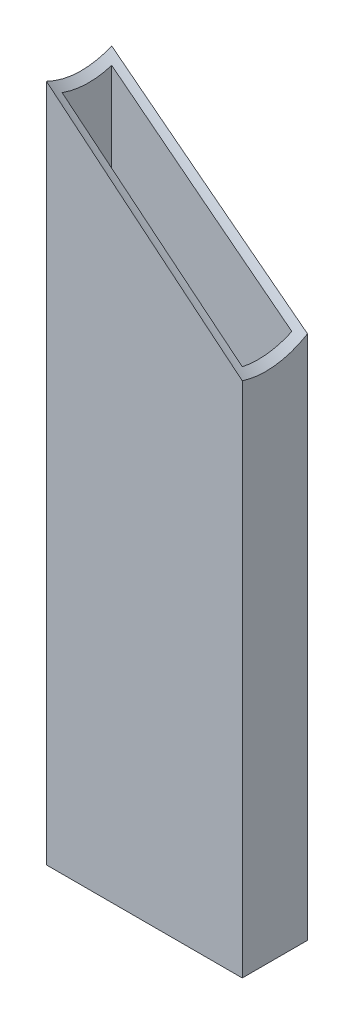
ISO-10303-21;
HEADER;
FILE_DESCRIPTION(('STEP AP214'),'2;1');
FILE_NAME('part.step','',(''),(''),'','','');
FILE_SCHEMA(('AUTOMOTIVE_DESIGN { 1 0 10303 214 1 1 1 1 }'));
ENDSEC;
DATA;
#1=APPLICATION_CONTEXT('core data for automotive mechanical design processes');
#2=APPLICATION_PROTOCOL_DEFINITION('international standard','automotive_design',2000,#1);
#3=PRODUCT_CONTEXT('',#1,'mechanical');
#4=PRODUCT('Part','Part','',(#3));
#5=PRODUCT_RELATED_PRODUCT_CATEGORY('part','',(#4));
#6=PRODUCT_DEFINITION_FORMATION('','',#4);
#7=PRODUCT_DEFINITION_CONTEXT('part definition',#1,'design');
#8=PRODUCT_DEFINITION('design','',#6,#7);
#9=PRODUCT_DEFINITION_SHAPE('','',#8);
#10=(LENGTH_UNIT() NAMED_UNIT(*) SI_UNIT(.MILLI.,.METRE.));
#11=(NAMED_UNIT(*) PLANE_ANGLE_UNIT() SI_UNIT($,.RADIAN.));
#12=(NAMED_UNIT(*) SI_UNIT($,.STERADIAN.) SOLID_ANGLE_UNIT());
#13=UNCERTAINTY_MEASURE_WITH_UNIT(LENGTH_MEASURE(1.E-05),#10,'distance_accuracy_value','');
#14=(GEOMETRIC_REPRESENTATION_CONTEXT(3) GLOBAL_UNCERTAINTY_ASSIGNED_CONTEXT((#13)) GLOBAL_UNIT_ASSIGNED_CONTEXT((#10,
#11,#12)) REPRESENTATION_CONTEXT('',''));
#15=CARTESIAN_POINT('',(0.,0.,0.));
#16=DIRECTION('',(0.,0.,1.));
#17=DIRECTION('',(1.,0.,0.));
#18=AXIS2_PLACEMENT_3D('',#15,#16,#17);
#19=CARTESIAN_POINT('',(-38.1,241.091915260124,-12.7));
#20=DIRECTION('',(1.,0.,0.));
#21=DIRECTION('',(0.,0.,-1.));
#22=AXIS2_PLACEMENT_3D('',#19,#20,#21);
#23=PLANE('',#22);
#24=CARTESIAN_POINT('',(-38.1,271.625058913714,-2.18034037703258));
#25=DIRECTION('',(1.,0.,0.));
#26=DIRECTION('',(0.,0.997460089010007,-0.0712275988093768));
#27=AXIS2_PLACEMENT_3D('',#24,#25,#26);
#28=ELLIPSE('',#27,48.8736815221693,38.0999999999998);
#29=CARTESIAN_POINT('',(-38.1,225.202525107177,-12.7));
#30=VERTEX_POINT('',#29);
#31=CARTESIAN_POINT('',(-38.1,226.013145758384,12.7));
#32=VERTEX_POINT('',#31);
#33=EDGE_CURVE('E165',#30,#32,#28,.F.);
#34=ORIENTED_EDGE('',*,*,#33,.F.);
#35=DIRECTION('',(0.,-1.,0.));
#36=VECTOR('',#35,1.);
#37=CARTESIAN_POINT('',(-38.1,241.091915260124,-12.7));
#38=LINE('',#37,#36);
#39=CARTESIAN_POINT('',(-38.1,-38.1,-12.7));
#40=VERTEX_POINT('',#39);
#41=EDGE_CURVE('E125',#30,#40,#38,.T.);
#42=ORIENTED_EDGE('',*,*,#41,.T.);
#43=DIRECTION('',(0.,0.,-1.));
#44=VECTOR('',#43,1.);
#45=CARTESIAN_POINT('',(-38.1,-38.1,12.7));
#46=LINE('',#45,#44);
#47=CARTESIAN_POINT('',(-38.1,-38.1,12.7));
#48=VERTEX_POINT('',#47);
#49=EDGE_CURVE('E143',#48,#40,#46,.T.);
#50=ORIENTED_EDGE('',*,*,#49,.F.);
#51=DIRECTION('',(0.,-1.,0.));
#52=VECTOR('',#51,1.);
#53=CARTESIAN_POINT('',(-38.1,241.091915260124,12.7));
#54=LINE('',#53,#52);
#55=EDGE_CURVE('E43',#32,#48,#54,.T.);
#56=ORIENTED_EDGE('',*,*,#55,.F.);
#57=EDGE_LOOP('',(#34,#42,#50,#56));
#58=FACE_BOUND('',#57,.T.);
#59=ADVANCED_FACE('F36',(#58),#23,.F.);
#60=CARTESIAN_POINT('',(-38.1,241.091915260124,12.7));
#61=DIRECTION('',(0.,0.,-1.));
#62=DIRECTION('',(-1.,0.,0.));
#63=AXIS2_PLACEMENT_3D('',#60,#61,#62);
#64=PLANE('',#63);
#65=CARTESIAN_POINT('',(221.924065204241,63.2431130798178,12.7));
#66=DIRECTION('',(0.,0.,-1.));
#67=DIRECTION('',(-0.780337575602446,0.625358511657831,0.));
#68=AXIS2_PLACEMENT_3D('',#65,#66,#67);
#69=ELLIPSE('',#68,854.035124795049,38.0999999999998);
#70=CARTESIAN_POINT('',(38.1,163.174497972245,12.7));
#71=VERTEX_POINT('',#70);
#72=EDGE_CURVE('E139',#32,#71,#69,.F.);
#73=ORIENTED_EDGE('',*,*,#72,.F.);
#74=ORIENTED_EDGE('',*,*,#55,.T.);
#75=DIRECTION('',(-1.,0.,0.));
#76=VECTOR('',#75,1.);
#77=CARTESIAN_POINT('',(38.1,-38.1,12.7));
#78=LINE('',#77,#76);
#79=CARTESIAN_POINT('',(38.1,-38.1,12.7));
#80=VERTEX_POINT('',#79);
#81=EDGE_CURVE('E138',#80,#48,#78,.T.);
#82=ORIENTED_EDGE('',*,*,#81,.F.);
#83=DIRECTION('',(0.,-1.,0.));
#84=VECTOR('',#83,1.);
#85=CARTESIAN_POINT('',(38.1,241.091915260124,12.7));
#86=LINE('',#85,#84);
#87=EDGE_CURVE('E129',#71,#80,#86,.T.);
#88=ORIENTED_EDGE('',*,*,#87,.F.);
#89=EDGE_LOOP('',(#73,#74,#82,#88));
#90=FACE_BOUND('',#89,.T.);
#91=ADVANCED_FACE('F135',(#90),#64,.F.);
#92=CARTESIAN_POINT('',(38.1,241.091915260124,-12.7));
#93=DIRECTION('',(-1.,0.,0.));
#94=DIRECTION('',(0.,0.,1.));
#95=AXIS2_PLACEMENT_3D('',#92,#93,#94);
#96=PLANE('',#95);
#97=CARTESIAN_POINT('',(38.1,210.558771606534,2.18034037703245));
#98=DIRECTION('',(-1.,0.,0.));
#99=DIRECTION('',(0.,0.997460089010007,-0.0712275988093768));
#100=AXIS2_PLACEMENT_3D('',#97,#98,#99);
#101=ELLIPSE('',#100,48.8736815221693,38.0999999999998);
#102=CARTESIAN_POINT('',(38.1,166.307265204278,-12.7));
#103=VERTEX_POINT('',#102);
#104=EDGE_CURVE('E50',#71,#103,#101,.F.);
#105=ORIENTED_EDGE('',*,*,#104,.F.);
#106=ORIENTED_EDGE('',*,*,#87,.T.);
#107=DIRECTION('',(0.,0.,1.));
#108=VECTOR('',#107,1.);
#109=CARTESIAN_POINT('',(38.1,-38.1,-12.7));
#110=LINE('',#109,#108);
#111=CARTESIAN_POINT('',(38.1,-38.1,-12.7));
#112=VERTEX_POINT('',#111);
#113=EDGE_CURVE('E120',#112,#80,#110,.T.);
#114=ORIENTED_EDGE('',*,*,#113,.F.);
#115=DIRECTION('',(0.,-1.,0.));
#116=VECTOR('',#115,1.);
#117=CARTESIAN_POINT('',(38.1,241.091915260124,-12.7));
#118=LINE('',#117,#116);
#119=EDGE_CURVE('E127',#103,#112,#118,.T.);
#120=ORIENTED_EDGE('',*,*,#119,.F.);
#121=EDGE_LOOP('',(#105,#106,#114,#120));
#122=FACE_BOUND('',#121,.T.);
#123=ADVANCED_FACE('F162',(#122),#96,.F.);
#124=CARTESIAN_POINT('',(-38.1,241.091915260124,-12.7));
#125=DIRECTION('',(0.,0.,1.));
#126=DIRECTION('',(1.,0.,0.));
#127=AXIS2_PLACEMENT_3D('',#124,#125,#126);
#128=PLANE('',#127);
#129=CARTESIAN_POINT('',(-221.924065204239,418.940717440429,-12.7));
#130=DIRECTION('',(0.,0.,1.));
#131=DIRECTION('',(-0.780337575602446,0.625358511657831,0.));
#132=AXIS2_PLACEMENT_3D('',#129,#130,#131);
#133=ELLIPSE('',#132,854.035124795052,38.0999999999998);
#134=EDGE_CURVE('E163',#103,#30,#133,.F.);
#135=ORIENTED_EDGE('',*,*,#134,.F.);
#136=ORIENTED_EDGE('',*,*,#119,.T.);
#137=DIRECTION('',(1.,0.,0.));
#138=VECTOR('',#137,1.);
#139=CARTESIAN_POINT('',(-38.1,-38.1,-12.7));
#140=LINE('',#139,#138);
#141=EDGE_CURVE('E148',#40,#112,#140,.T.);
#142=ORIENTED_EDGE('',*,*,#141,.F.);
#143=ORIENTED_EDGE('',*,*,#41,.F.);
#144=EDGE_LOOP('',(#135,#136,#142,#143));
#145=FACE_BOUND('',#144,.T.);
#146=ADVANCED_FACE('F191',(#145),#128,.F.);
#147=CARTESIAN_POINT('',(-35.052,241.091915260124,-9.65199999999999));
#148=DIRECTION('',(1.,0.,0.));
#149=DIRECTION('',(0.,0.,-1.));
#150=AXIS2_PLACEMENT_3D('',#147,#148,#149);
#151=PLANE('',#150);
#152=DIRECTION('',(0.,-1.,0.));
#153=VECTOR('',#152,1.);
#154=CARTESIAN_POINT('',(-35.052,241.091915260124,-9.65199999999999));
#155=LINE('',#154,#153);
#156=CARTESIAN_POINT('',(-35.052,221.727466504073,-9.65199999999999));
#157=VERTEX_POINT('',#156);
#158=CARTESIAN_POINT('',(-35.052,-38.1,-9.65199999999999));
#159=VERTEX_POINT('',#158);
#160=EDGE_CURVE('E116',#157,#159,#155,.T.);
#161=ORIENTED_EDGE('',*,*,#160,.F.);
#162=CARTESIAN_POINT('',(-35.052,269.182407421426,-2.00591314686998));
#163=DIRECTION('',(1.,0.,0.));
#164=DIRECTION('',(0.,0.997460089010007,-0.0712275988093772));
#165=AXIS2_PLACEMENT_3D('',#162,#163,#164);
#166=ELLIPSE('',#165,48.8736815221693,38.0999999999998);
#167=CARTESIAN_POINT('',(-35.052,222.188110434694,9.652));
#168=VERTEX_POINT('',#167);
#169=EDGE_CURVE('E58',#157,#168,#166,.F.);
#170=ORIENTED_EDGE('',*,*,#169,.T.);
#171=DIRECTION('',(0.,-1.,0.));
#172=VECTOR('',#171,1.);
#173=CARTESIAN_POINT('',(-35.052,241.091915260124,9.652));
#174=LINE('',#173,#172);
#175=CARTESIAN_POINT('',(-35.052,-38.1,9.652));
#176=VERTEX_POINT('',#175);
#177=EDGE_CURVE('E118',#168,#176,#174,.T.);
#178=ORIENTED_EDGE('',*,*,#177,.T.);
#179=DIRECTION('',(0.,0.,-1.));
#180=VECTOR('',#179,1.);
#181=CARTESIAN_POINT('',(-35.052,-38.1,-9.65199999999999));
#182=LINE('',#181,#180);
#183=EDGE_CURVE('E174',#176,#159,#182,.T.);
#184=ORIENTED_EDGE('',*,*,#183,.T.);
#185=EDGE_LOOP('',(#161,#170,#178,#184));
#186=FACE_BOUND('',#185,.T.);
#187=ADVANCED_FACE('F178',(#186),#151,.T.);
#188=CARTESIAN_POINT('',(-35.052,241.091915260124,9.652));
#189=DIRECTION('',(0.,0.,-1.));
#190=DIRECTION('',(-1.,0.,0.));
#191=AXIS2_PLACEMENT_3D('',#188,#189,#190);
#192=PLANE('',#191);
#193=ORIENTED_EDGE('',*,*,#177,.F.);
#194=CARTESIAN_POINT('',(168.662289555223,105.926825603091,9.65199999999997));
#195=DIRECTION('',(0.,0.,-1.));
#196=DIRECTION('',(-0.780337575602446,0.625358511657831,0.));
#197=AXIS2_PLACEMENT_3D('',#194,#195,#196);
#198=ELLIPSE('',#197,854.035124795049,38.0999999999998);
#199=CARTESIAN_POINT('',(35.052,164.847453266402,9.65199999999999));
#200=VERTEX_POINT('',#199);
#201=EDGE_CURVE('E110',#168,#200,#198,.F.);
#202=ORIENTED_EDGE('',*,*,#201,.T.);
#203=DIRECTION('',(0.,-1.,0.));
#204=VECTOR('',#203,1.);
#205=CARTESIAN_POINT('',(35.052,241.091915260124,9.65199999999999));
#206=LINE('',#205,#204);
#207=CARTESIAN_POINT('',(35.052,-38.1,9.65199999999999));
#208=VERTEX_POINT('',#207);
#209=EDGE_CURVE('E109',#200,#208,#206,.T.);
#210=ORIENTED_EDGE('',*,*,#209,.T.);
#211=DIRECTION('',(-1.,0.,0.));
#212=VECTOR('',#211,1.);
#213=CARTESIAN_POINT('',(-35.052,-38.1,9.652));
#214=LINE('',#213,#212);
#215=EDGE_CURVE('E171',#208,#176,#214,.T.);
#216=ORIENTED_EDGE('',*,*,#215,.T.);
#217=EDGE_LOOP('',(#193,#202,#210,#216));
#218=FACE_BOUND('',#217,.T.);
#219=ADVANCED_FACE('F182',(#218),#192,.T.);
#220=CARTESIAN_POINT('',(35.052,241.091915260124,-9.652));
#221=DIRECTION('',(-1.,0.,0.));
#222=DIRECTION('',(0.,0.,1.));
#223=AXIS2_PLACEMENT_3D('',#220,#221,#222);
#224=PLANE('',#223);
#225=ORIENTED_EDGE('',*,*,#209,.F.);
#226=CARTESIAN_POINT('',(35.052,213.001423098822,2.00591314686985));
#227=DIRECTION('',(-1.,0.,0.));
#228=DIRECTION('',(0.,0.997460089010007,-0.0712275988093772));
#229=AXIS2_PLACEMENT_3D('',#226,#227,#228);
#230=ELLIPSE('',#229,48.8736815221693,38.0999999999998);
#231=CARTESIAN_POINT('',(35.052,167.07292859845,-9.652));
#232=VERTEX_POINT('',#231);
#233=EDGE_CURVE('E98',#200,#232,#230,.F.);
#234=ORIENTED_EDGE('',*,*,#233,.T.);
#235=DIRECTION('',(0.,-1.,0.));
#236=VECTOR('',#235,1.);
#237=CARTESIAN_POINT('',(35.052,241.091915260124,-9.652));
#238=LINE('',#237,#236);
#239=CARTESIAN_POINT('',(35.052,-38.1,-9.652));
#240=VERTEX_POINT('',#239);
#241=EDGE_CURVE('E107',#232,#240,#238,.T.);
#242=ORIENTED_EDGE('',*,*,#241,.T.);
#243=DIRECTION('',(0.,0.,1.));
#244=VECTOR('',#243,1.);
#245=CARTESIAN_POINT('',(35.052,-38.1,9.65199999999999));
#246=LINE('',#245,#244);
#247=EDGE_CURVE('E154',#240,#208,#246,.T.);
#248=ORIENTED_EDGE('',*,*,#247,.T.);
#249=EDGE_LOOP('',(#225,#234,#242,#248));
#250=FACE_BOUND('',#249,.T.);
#251=ADVANCED_FACE('F105',(#250),#224,.T.);
#252=CARTESIAN_POINT('',(-35.052,241.091915260124,-9.65199999999999));
#253=DIRECTION('',(0.,0.,1.));
#254=DIRECTION('',(1.,0.,0.));
#255=AXIS2_PLACEMENT_3D('',#252,#253,#254);
#256=PLANE('',#255);
#257=ORIENTED_EDGE('',*,*,#241,.F.);
#258=CARTESIAN_POINT('',(-168.66228955522,376.257004917155,-9.65199999999997));
#259=DIRECTION('',(0.,0.,1.));
#260=DIRECTION('',(-0.780337575602446,0.625358511657831,0.));
#261=AXIS2_PLACEMENT_3D('',#258,#259,#260);
#262=ELLIPSE('',#261,854.035124795049,38.0999999999998);
#263=EDGE_CURVE('E11',#232,#157,#262,.F.);
#264=ORIENTED_EDGE('',*,*,#263,.T.);
#265=ORIENTED_EDGE('',*,*,#160,.T.);
#266=DIRECTION('',(1.,0.,0.));
#267=VECTOR('',#266,1.);
#268=CARTESIAN_POINT('',(35.052,-38.1,-9.652));
#269=LINE('',#268,#267);
#270=EDGE_CURVE('E114',#159,#240,#269,.T.);
#271=ORIENTED_EDGE('',*,*,#270,.T.);
#272=EDGE_LOOP('',(#257,#264,#265,#271));
#273=FACE_BOUND('',#272,.T.);
#274=ADVANCED_FACE('F112',(#273),#256,.T.);
#275=CARTESIAN_POINT('',(0.,-38.1,0.));
#276=DIRECTION('',(0.,-1.,0.));
#277=DIRECTION('',(0.,0.,-1.));
#278=AXIS2_PLACEMENT_3D('',#275,#276,#277);
#279=PLANE('',#278);
#280=ORIENTED_EDGE('',*,*,#81,.T.);
#281=ORIENTED_EDGE('',*,*,#49,.T.);
#282=ORIENTED_EDGE('',*,*,#141,.T.);
#283=ORIENTED_EDGE('',*,*,#113,.T.);
#284=EDGE_LOOP('',(#280,#281,#282,#283));
#285=FACE_BOUND('',#284,.T.);
#286=ORIENTED_EDGE('',*,*,#183,.F.);
#287=ORIENTED_EDGE('',*,*,#215,.F.);
#288=ORIENTED_EDGE('',*,*,#247,.F.);
#289=ORIENTED_EDGE('',*,*,#270,.F.);
#290=EDGE_LOOP('',(#286,#287,#288,#289));
#291=FACE_BOUND('',#290,.T.);
#292=ADVANCED_FACE('F151',(#285,#291),#279,.T.);
#293=CARTESIAN_POINT('',(89.8894318628016,169.054987805886,5.14408288081304));
#294=DIRECTION('',(-0.779560671784414,0.624735904941794,-0.0446117482687178));
#295=DIRECTION('',(-0.625358511657831,-0.780337575602446,0.));
#296=AXIS2_PLACEMENT_3D('',#293,#294,#295);
#297=CYLINDRICAL_SURFACE('',#296,38.0999999999998);
#298=ORIENTED_EDGE('',*,*,#263,.F.);
#299=ORIENTED_EDGE('',*,*,#233,.F.);
#300=ORIENTED_EDGE('',*,*,#201,.F.);
#301=ORIENTED_EDGE('',*,*,#169,.F.);
#302=EDGE_LOOP('',(#298,#299,#300,#301));
#303=FACE_BOUND('',#302,.T.);
#304=ORIENTED_EDGE('',*,*,#33,.T.);
#305=ORIENTED_EDGE('',*,*,#72,.T.);
#306=ORIENTED_EDGE('',*,*,#104,.T.);
#307=ORIENTED_EDGE('',*,*,#134,.T.);
#308=EDGE_LOOP('',(#304,#305,#306,#307));
#309=FACE_BOUND('',#308,.T.);
#310=ADVANCED_FACE('F97',(#303,#309),#297,.F.);
#311=CLOSED_SHELL('',(#59,#91,#123,#146,#187,#219,#251,#274,#292,#310));
#312=MANIFOLD_SOLID_BREP('B2',#311);
#313=ADVANCED_BREP_SHAPE_REPRESENTATION('',(#18,#312),#14);
#314=SHAPE_DEFINITION_REPRESENTATION(#9,#313);
ENDSEC;
END-ISO-10303-21;
